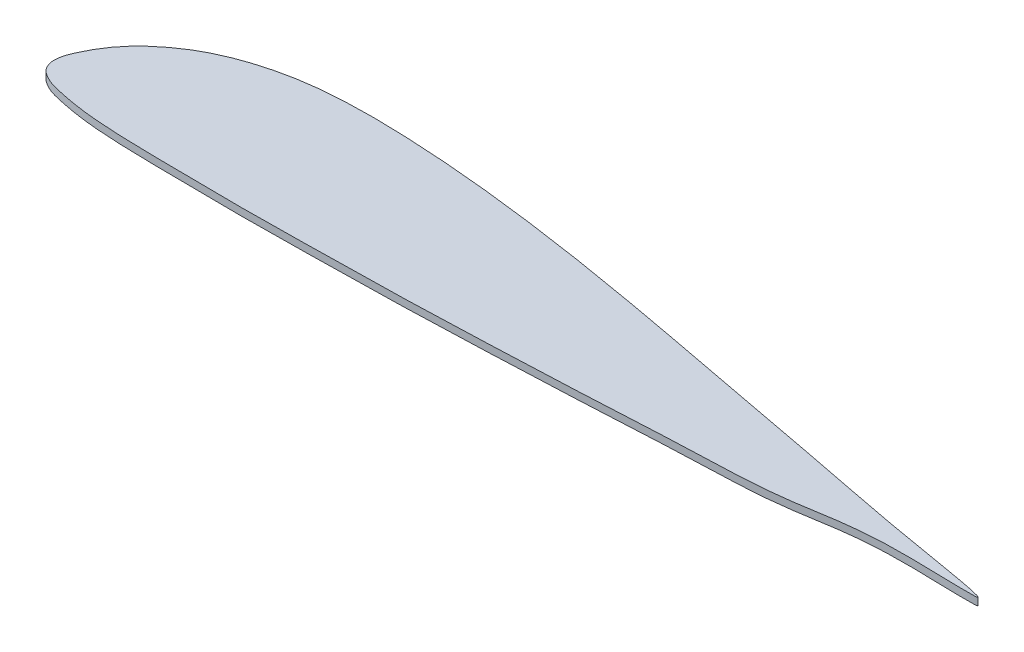
ISO-10303-21;
HEADER;
FILE_DESCRIPTION(('STEP AP214'),'2;1');
FILE_NAME('part.step','',(''),(''),'','','');
FILE_SCHEMA(('AUTOMOTIVE_DESIGN { 1 0 10303 214 1 1 1 1 }'));
ENDSEC;
DATA;
#1=APPLICATION_CONTEXT('core data for automotive mechanical design processes');
#2=APPLICATION_PROTOCOL_DEFINITION('international standard','automotive_design',2000,#1);
#3=PRODUCT_CONTEXT('',#1,'mechanical');
#4=PRODUCT('Part','Part','',(#3));
#5=PRODUCT_RELATED_PRODUCT_CATEGORY('part','',(#4));
#6=PRODUCT_DEFINITION_FORMATION('','',#4);
#7=PRODUCT_DEFINITION_CONTEXT('part definition',#1,'design');
#8=PRODUCT_DEFINITION('design','',#6,#7);
#9=PRODUCT_DEFINITION_SHAPE('','',#8);
#10=(LENGTH_UNIT() NAMED_UNIT(*) SI_UNIT(.MILLI.,.METRE.));
#11=(NAMED_UNIT(*) PLANE_ANGLE_UNIT() SI_UNIT($,.RADIAN.));
#12=(NAMED_UNIT(*) SI_UNIT($,.STERADIAN.) SOLID_ANGLE_UNIT());
#13=UNCERTAINTY_MEASURE_WITH_UNIT(LENGTH_MEASURE(1.E-05),#10,'distance_accuracy_value','');
#14=(GEOMETRIC_REPRESENTATION_CONTEXT(3) GLOBAL_UNCERTAINTY_ASSIGNED_CONTEXT((#13)) GLOBAL_UNIT_ASSIGNED_CONTEXT((#10,
#11,#12)) REPRESENTATION_CONTEXT('',''));
#15=CARTESIAN_POINT('',(0.,0.,0.));
#16=DIRECTION('',(0.,0.,1.));
#17=DIRECTION('',(1.,0.,0.));
#18=AXIS2_PLACEMENT_3D('',#15,#16,#17);
#19=CARTESIAN_POINT('',(100.,4.,0.));
#20=CARTESIAN_POINT('',(100.314162404536,4.,-1.25517745458424));
#21=CARTESIAN_POINT('',(42.1189148691305,4.,-10.3858577240385));
#22=CARTESIAN_POINT('',(2.11255435123937,4.,-18.7667317839889));
#23=CARTESIAN_POINT('',(-50.569132274088,4.,-28.5472151400058));
#24=CARTESIAN_POINT('',(-99.806676328424,4.,-38.0387500553579));
#25=CARTESIAN_POINT('',(-149.916309846019,4.,-47.2439744562619));
#26=CARTESIAN_POINT('',(-199.836765032956,4.,-54.8701240191615));
#27=CARTESIAN_POINT('',(-241.592788117939,4.,-59.2880861677066));
#28=CARTESIAN_POINT('',(-274.981335376713,4.,-61.0940111669891));
#29=CARTESIAN_POINT('',(-300.043563287523,4.,-61.2795083525107));
#30=CARTESIAN_POINT('',(-325.339866277662,4.,-59.1576263105721));
#31=CARTESIAN_POINT('',(-347.236505464833,4.,-53.5859740557002));
#32=CARTESIAN_POINT('',(-363.869926710221,4.,-46.3213414649243));
#33=CARTESIAN_POINT('',(-375.529285944834,4.,-38.7045018305027));
#34=CARTESIAN_POINT('',(-383.863414122656,4.,-31.5103434793881));
#35=CARTESIAN_POINT('',(-390.462113475872,4.,-23.9228746180628));
#36=CARTESIAN_POINT('',(-394.547433257089,4.,-17.5880148859599));
#37=CARTESIAN_POINT('',(-398.444478297918,4.,-9.74871784914186));
#38=CARTESIAN_POINT('',(-401.373466063911,4.,-1.93978605548806));
#39=CARTESIAN_POINT('',(-398.38792599084,4.,4.92995629734993));
#40=CARTESIAN_POINT('',(-394.359570070841,4.,7.76637949416649));
#41=CARTESIAN_POINT('',(-390.196284637074,4.,9.9020110131118));
#42=CARTESIAN_POINT('',(-383.374621005311,4.,11.5719945924856));
#43=CARTESIAN_POINT('',(-375.057625707095,4.,13.2575972070985));
#44=CARTESIAN_POINT('',(-363.370532588611,4.,14.8041488644949));
#45=CARTESIAN_POINT('',(-346.686488623062,4.,15.9164907858547));
#46=CARTESIAN_POINT('',(-325.00128415212,4.,16.2615496129469));
#47=CARTESIAN_POINT('',(-300.001488083157,4.,16.5899536800256));
#48=CARTESIAN_POINT('',(-274.998479083424,4.,16.6785745746141));
#49=CARTESIAN_POINT('',(-241.666940865024,4.,16.1680784337318));
#50=CARTESIAN_POINT('',(-199.97729094052,4.,15.5940139626574));
#51=CARTESIAN_POINT('',(-150.031486347118,4.,13.7395855373605));
#52=CARTESIAN_POINT('',(-99.8396426382899,4.,11.6453966699807));
#53=CARTESIAN_POINT('',(-50.5637007749723,4.,8.67646765715776));
#54=CARTESIAN_POINT('',(2.25090877841247,4.,7.64447894945911));
#55=CARTESIAN_POINT('',(42.0873007253256,4.,-2.70485156683243));
#56=CARTESIAN_POINT('',(99.6913591719747,4.,1.23311702262332));
#57=CARTESIAN_POINT('',(100.,4.,0.));
#58=B_SPLINE_CURVE_WITH_KNOTS('',3,(#19,#20,#21,#22,#23,#24,#25,#26,#27,#28,#29,#30,#31,#32,#33,
#34,#35,#36,#37,#38,#39,#40,#41,#42,#43,#44,#45,#46,#47,#48,#49,#50,#51,#52,#53,#54,#55,#56,
#57),.UNSPECIFIED.,.T.,.F.,(4,1,1,1,1,1,1,1,1,1,1,1,1,1,1,1,1,1,1,1,1,1,1,1,1,1,1,1,1,1,1,1,1,1,
1,1,4),(0.,0.0490408656764944,0.0980817313529888,0.147122597029483,0.196163462705978,
0.245116685545263,0.293834629256661,0.342263553193416,0.366385572960314,0.390475045746911,
0.414675268241992,0.439565651155836,0.455415352681607,0.466907823883372,0.479711554297043,
0.48709032929319,0.495936907344408,0.501323477213704,0.512663454203477,0.518310059511212,
0.521365151754157,0.526751721623453,0.531754914327112,0.541581529671993,0.551304728452871,
0.565797224363326,0.589894838016151,0.613986045182352,0.638075566147846,0.662166773314048,
0.710353523244322,0.758560308204797,0.806785868446715,0.85502500010905,0.903284914630983,
0.951821054426205,1.),.UNSPECIFIED.);
#59=DIRECTION('',(0.,-1.,0.));
#60=VECTOR('',#59,1.);
#61=SURFACE_OF_LINEAR_EXTRUSION('',#58,#60);
#62=CARTESIAN_POINT('',(100.,4.,0.));
#63=VERTEX_POINT('',#62);
#64=EDGE_CURVE('E10',#63,#63,#58,.T.);
#65=ORIENTED_EDGE('',*,*,#64,.F.);
#66=EDGE_LOOP('',(#65));
#67=FACE_BOUND('',#66,.T.);
#68=CARTESIAN_POINT('',(100.,0.,0.));
#69=CARTESIAN_POINT('',(100.314162404536,0.,-1.25517745458424));
#70=CARTESIAN_POINT('',(42.1189148691305,0.,-10.3858577240385));
#71=CARTESIAN_POINT('',(2.11255435123937,0.,-18.7667317839889));
#72=CARTESIAN_POINT('',(-50.569132274088,0.,-28.5472151400058));
#73=CARTESIAN_POINT('',(-99.806676328424,0.,-38.0387500553579));
#74=CARTESIAN_POINT('',(-149.916309846019,0.,-47.2439744562619));
#75=CARTESIAN_POINT('',(-199.836765032956,0.,-54.8701240191615));
#76=CARTESIAN_POINT('',(-241.592788117939,0.,-59.2880861677066));
#77=CARTESIAN_POINT('',(-274.981335376713,0.,-61.0940111669891));
#78=CARTESIAN_POINT('',(-300.043563287523,0.,-61.2795083525107));
#79=CARTESIAN_POINT('',(-325.339866277662,0.,-59.1576263105721));
#80=CARTESIAN_POINT('',(-347.236505464833,0.,-53.5859740557002));
#81=CARTESIAN_POINT('',(-363.869926710221,0.,-46.3213414649243));
#82=CARTESIAN_POINT('',(-375.529285944834,0.,-38.7045018305027));
#83=CARTESIAN_POINT('',(-383.863414122656,0.,-31.5103434793881));
#84=CARTESIAN_POINT('',(-390.462113475872,0.,-23.9228746180628));
#85=CARTESIAN_POINT('',(-394.547433257089,0.,-17.5880148859599));
#86=CARTESIAN_POINT('',(-398.444478297918,0.,-9.74871784914186));
#87=CARTESIAN_POINT('',(-401.373466063911,0.,-1.93978605548806));
#88=CARTESIAN_POINT('',(-398.38792599084,0.,4.92995629734993));
#89=CARTESIAN_POINT('',(-394.359570070841,0.,7.76637949416649));
#90=CARTESIAN_POINT('',(-390.196284637074,0.,9.9020110131118));
#91=CARTESIAN_POINT('',(-383.374621005311,0.,11.5719945924856));
#92=CARTESIAN_POINT('',(-375.057625707095,0.,13.2575972070985));
#93=CARTESIAN_POINT('',(-363.370532588611,0.,14.8041488644949));
#94=CARTESIAN_POINT('',(-346.686488623062,0.,15.9164907858547));
#95=CARTESIAN_POINT('',(-325.00128415212,0.,16.2615496129469));
#96=CARTESIAN_POINT('',(-300.001488083157,0.,16.5899536800256));
#97=CARTESIAN_POINT('',(-274.998479083424,0.,16.6785745746141));
#98=CARTESIAN_POINT('',(-241.666940865024,0.,16.1680784337318));
#99=CARTESIAN_POINT('',(-199.97729094052,0.,15.5940139626574));
#100=CARTESIAN_POINT('',(-150.031486347118,0.,13.7395855373605));
#101=CARTESIAN_POINT('',(-99.8396426382899,0.,11.6453966699807));
#102=CARTESIAN_POINT('',(-50.5637007749723,0.,8.67646765715776));
#103=CARTESIAN_POINT('',(2.25090877841247,0.,7.64447894945911));
#104=CARTESIAN_POINT('',(42.0873007253256,0.,-2.70485156683243));
#105=CARTESIAN_POINT('',(99.6913591719747,0.,1.23311702262332));
#106=CARTESIAN_POINT('',(100.,0.,0.));
#107=B_SPLINE_CURVE_WITH_KNOTS('',3,(#68,#69,#70,#71,#72,#73,#74,#75,#76,#77,#78,#79,#80,#81,
#82,#83,#84,#85,#86,#87,#88,#89,#90,#91,#92,#93,#94,#95,#96,#97,#98,#99,#100,#101,#102,#103,
#104,#105,#106),.UNSPECIFIED.,.T.,.F.,(4,1,1,1,1,1,1,1,1,1,1,1,1,1,1,1,1,1,1,1,1,1,1,1,1,1,1,1,
1,1,1,1,1,1,1,1,4),(0.,0.0490408656764944,0.0980817313529888,0.147122597029483,
0.196163462705978,0.245116685545263,0.293834629256661,0.342263553193416,0.366385572960314,
0.390475045746911,0.414675268241992,0.439565651155836,0.455415352681607,0.466907823883372,
0.479711554297043,0.48709032929319,0.495936907344408,0.501323477213704,0.512663454203477,
0.518310059511212,0.521365151754157,0.526751721623453,0.531754914327112,0.541581529671993,
0.551304728452871,0.565797224363326,0.589894838016151,0.613986045182352,0.638075566147846,
0.662166773314048,0.710353523244322,0.758560308204797,0.806785868446715,0.85502500010905,
0.903284914630983,0.951821054426205,1.),.UNSPECIFIED.);
#108=CARTESIAN_POINT('',(100.,0.,0.));
#109=VERTEX_POINT('',#108);
#110=EDGE_CURVE('E35',#109,#109,#107,.T.);
#111=ORIENTED_EDGE('',*,*,#110,.T.);
#112=EDGE_LOOP('',(#111));
#113=FACE_BOUND('',#112,.T.);
#114=ADVANCED_FACE('F31',(#67,#113),#61,.F.);
#115=CARTESIAN_POINT('',(-396.915107250429,4.,-12.7587780129395));
#116=DIRECTION('',(0.,-1.,0.));
#117=DIRECTION('',(0.,0.,-1.));
#118=AXIS2_PLACEMENT_3D('',#115,#116,#117);
#119=PLANE('',#118);
#120=ORIENTED_EDGE('',*,*,#64,.T.);
#121=EDGE_LOOP('',(#120));
#122=FACE_BOUND('',#121,.T.);
#123=ADVANCED_FACE('F54',(#122),#119,.F.);
#124=CARTESIAN_POINT('',(-396.915107250429,0.,-12.7587780129395));
#125=DIRECTION('',(0.,-1.,0.));
#126=DIRECTION('',(0.,0.,-1.));
#127=AXIS2_PLACEMENT_3D('',#124,#125,#126);
#128=PLANE('',#127);
#129=ORIENTED_EDGE('',*,*,#110,.F.);
#130=EDGE_LOOP('',(#129));
#131=FACE_BOUND('',#130,.T.);
#132=ADVANCED_FACE('F52',(#131),#128,.T.);
#133=CLOSED_SHELL('',(#114,#123,#132));
#134=MANIFOLD_SOLID_BREP('B2',#133);
#135=ADVANCED_BREP_SHAPE_REPRESENTATION('',(#18,#134),#14);
#136=SHAPE_DEFINITION_REPRESENTATION(#9,#135);
ENDSEC;
END-ISO-10303-21;
